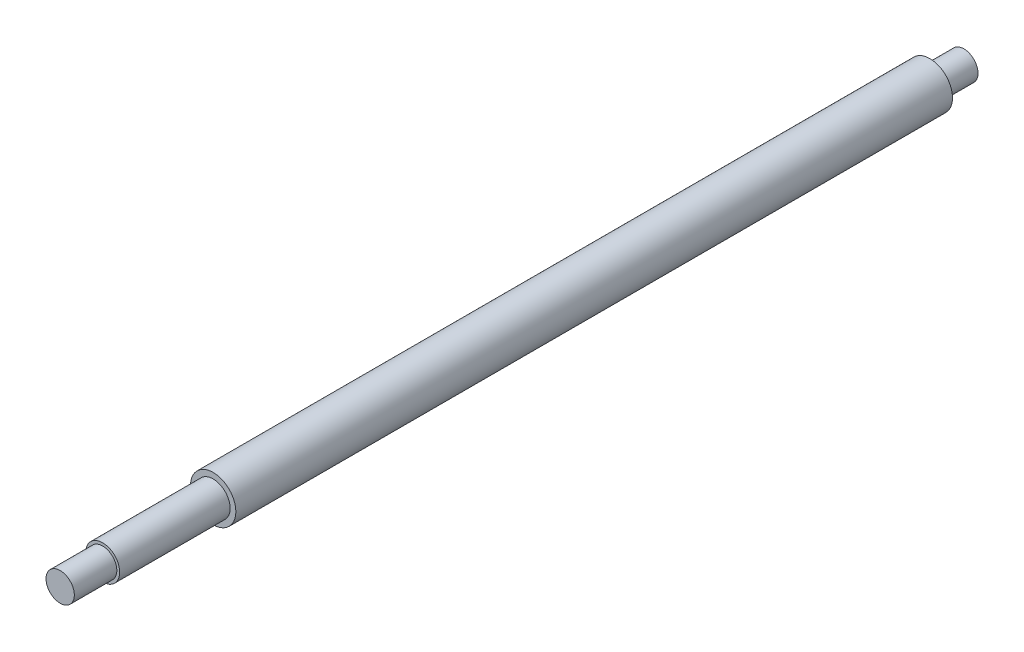
ISO-10303-21;
HEADER;
FILE_DESCRIPTION(('STEP AP214'),'2;1');
FILE_NAME('part.step','',(''),(''),'','','');
FILE_SCHEMA(('AUTOMOTIVE_DESIGN { 1 0 10303 214 1 1 1 1 }'));
ENDSEC;
DATA;
#1=APPLICATION_CONTEXT('core data for automotive mechanical design processes');
#2=APPLICATION_PROTOCOL_DEFINITION('international standard','automotive_design',2000,#1);
#3=PRODUCT_CONTEXT('',#1,'mechanical');
#4=PRODUCT('Part','Part','',(#3));
#5=PRODUCT_RELATED_PRODUCT_CATEGORY('part','',(#4));
#6=PRODUCT_DEFINITION_FORMATION('','',#4);
#7=PRODUCT_DEFINITION_CONTEXT('part definition',#1,'design');
#8=PRODUCT_DEFINITION('design','',#6,#7);
#9=PRODUCT_DEFINITION_SHAPE('','',#8);
#10=(LENGTH_UNIT() NAMED_UNIT(*) SI_UNIT(.MILLI.,.METRE.));
#11=(NAMED_UNIT(*) PLANE_ANGLE_UNIT() SI_UNIT($,.RADIAN.));
#12=(NAMED_UNIT(*) SI_UNIT($,.STERADIAN.) SOLID_ANGLE_UNIT());
#13=UNCERTAINTY_MEASURE_WITH_UNIT(LENGTH_MEASURE(1.E-05),#10,'distance_accuracy_value','');
#14=(GEOMETRIC_REPRESENTATION_CONTEXT(3) GLOBAL_UNCERTAINTY_ASSIGNED_CONTEXT((#13)) GLOBAL_UNIT_ASSIGNED_CONTEXT((#10,
#11,#12)) REPRESENTATION_CONTEXT('',''));
#15=CARTESIAN_POINT('',(0.,0.,0.));
#16=DIRECTION('',(0.,0.,1.));
#17=DIRECTION('',(1.,0.,0.));
#18=AXIS2_PLACEMENT_3D('',#15,#16,#17);
#19=CARTESIAN_POINT('',(0.,0.,318.98));
#20=DIRECTION('',(0.,0.,1.));
#21=DIRECTION('',(1.,0.,0.));
#22=AXIS2_PLACEMENT_3D('',#19,#20,#21);
#23=PLANE('',#22);
#24=CARTESIAN_POINT('',(0.,0.,318.98));
#25=DIRECTION('',(0.,0.,-1.));
#26=DIRECTION('',(-1.,0.,0.));
#27=AXIS2_PLACEMENT_3D('',#24,#25,#26);
#28=CIRCLE('',#27,4.99999999999994);
#29=CARTESIAN_POINT('',(-4.99999999999994,0.,318.98));
#30=VERTEX_POINT('',#29);
#31=EDGE_CURVE('E10',#30,#30,#28,.T.);
#32=ORIENTED_EDGE('',*,*,#31,.F.);
#33=EDGE_LOOP('',(#32));
#34=FACE_BOUND('',#33,.T.);
#35=ADVANCED_FACE('F34',(#34),#23,.T.);
#36=CARTESIAN_POINT('',(0.,0.,0.));
#37=DIRECTION('',(0.,0.,-1.));
#38=DIRECTION('',(-1.,0.,0.));
#39=AXIS2_PLACEMENT_3D('',#36,#37,#38);
#40=CYLINDRICAL_SURFACE('',#39,4.99999999999994);
#41=ORIENTED_EDGE('',*,*,#31,.T.);
#42=EDGE_LOOP('',(#41));
#43=FACE_BOUND('',#42,.T.);
#44=CARTESIAN_POINT('',(0.,0.,303.98));
#45=DIRECTION('',(0.,0.,-1.));
#46=DIRECTION('',(-1.,0.,0.));
#47=AXIS2_PLACEMENT_3D('',#44,#45,#46);
#48=CIRCLE('',#47,4.99999999999994);
#49=CARTESIAN_POINT('',(-4.99999999999994,0.,303.98));
#50=VERTEX_POINT('',#49);
#51=EDGE_CURVE('E40',#50,#50,#48,.T.);
#52=ORIENTED_EDGE('',*,*,#51,.F.);
#53=EDGE_LOOP('',(#52));
#54=FACE_BOUND('',#53,.T.);
#55=ADVANCED_FACE('F82',(#43,#54),#40,.T.);
#56=CARTESIAN_POINT('',(0.,4.99999999999994,303.98));
#57=DIRECTION('',(0.,0.,1.));
#58=DIRECTION('',(1.,0.,0.));
#59=AXIS2_PLACEMENT_3D('',#56,#57,#58);
#60=PLANE('',#59);
#61=ORIENTED_EDGE('',*,*,#51,.T.);
#62=EDGE_LOOP('',(#61));
#63=FACE_BOUND('',#62,.T.);
#64=CARTESIAN_POINT('',(0.,0.,303.98));
#65=DIRECTION('',(0.,0.,-1.));
#66=DIRECTION('',(-1.,0.,0.));
#67=AXIS2_PLACEMENT_3D('',#64,#65,#66);
#68=CIRCLE('',#67,5.99999999999994);
#69=CARTESIAN_POINT('',(-5.99999999999994,0.,303.98));
#70=VERTEX_POINT('',#69);
#71=EDGE_CURVE('E44',#70,#70,#68,.T.);
#72=ORIENTED_EDGE('',*,*,#71,.F.);
#73=EDGE_LOOP('',(#72));
#74=FACE_BOUND('',#73,.T.);
#75=ADVANCED_FACE('F87',(#63,#74),#60,.T.);
#76=CARTESIAN_POINT('',(0.,0.,0.));
#77=DIRECTION('',(0.,0.,-1.));
#78=DIRECTION('',(-1.,0.,0.));
#79=AXIS2_PLACEMENT_3D('',#76,#77,#78);
#80=CYLINDRICAL_SURFACE('',#79,5.99999999999994);
#81=ORIENTED_EDGE('',*,*,#71,.T.);
#82=EDGE_LOOP('',(#81));
#83=FACE_BOUND('',#82,.T.);
#84=CARTESIAN_POINT('',(0.,0.,264.98));
#85=DIRECTION('',(0.,0.,-1.));
#86=DIRECTION('',(-1.,0.,0.));
#87=AXIS2_PLACEMENT_3D('',#84,#85,#86);
#88=CIRCLE('',#87,5.99999999999994);
#89=CARTESIAN_POINT('',(-5.99999999999994,0.,264.98));
#90=VERTEX_POINT('',#89);
#91=EDGE_CURVE('E48',#90,#90,#88,.T.);
#92=ORIENTED_EDGE('',*,*,#91,.F.);
#93=EDGE_LOOP('',(#92));
#94=FACE_BOUND('',#93,.T.);
#95=ADVANCED_FACE('F91',(#83,#94),#80,.T.);
#96=CARTESIAN_POINT('',(0.,5.99999999999994,264.98));
#97=DIRECTION('',(0.,0.,1.));
#98=DIRECTION('',(1.,0.,0.));
#99=AXIS2_PLACEMENT_3D('',#96,#97,#98);
#100=PLANE('',#99);
#101=ORIENTED_EDGE('',*,*,#91,.T.);
#102=EDGE_LOOP('',(#101));
#103=FACE_BOUND('',#102,.T.);
#104=CARTESIAN_POINT('',(0.,0.,264.98));
#105=DIRECTION('',(0.,0.,-1.));
#106=DIRECTION('',(-1.,0.,0.));
#107=AXIS2_PLACEMENT_3D('',#104,#105,#106);
#108=CIRCLE('',#107,7.99999999999995);
#109=CARTESIAN_POINT('',(-7.99999999999995,0.,264.98));
#110=VERTEX_POINT('',#109);
#111=EDGE_CURVE('E53',#110,#110,#108,.T.);
#112=ORIENTED_EDGE('',*,*,#111,.F.);
#113=EDGE_LOOP('',(#112));
#114=FACE_BOUND('',#113,.T.);
#115=ADVANCED_FACE('F97',(#103,#114),#100,.T.);
#116=CARTESIAN_POINT('',(0.,0.,0.));
#117=DIRECTION('',(0.,0.,-1.));
#118=DIRECTION('',(-1.,0.,0.));
#119=AXIS2_PLACEMENT_3D('',#116,#117,#118);
#120=CYLINDRICAL_SURFACE('',#119,7.99999999999997);
#121=ORIENTED_EDGE('',*,*,#111,.T.);
#122=EDGE_LOOP('',(#121));
#123=FACE_BOUND('',#122,.T.);
#124=CARTESIAN_POINT('',(0.,0.,12.));
#125=DIRECTION('',(0.,0.,-1.));
#126=DIRECTION('',(-1.,0.,0.));
#127=AXIS2_PLACEMENT_3D('',#124,#125,#126);
#128=CIRCLE('',#127,7.99999999999999);
#129=CARTESIAN_POINT('',(-7.99999999999999,0.,12.));
#130=VERTEX_POINT('',#129);
#131=EDGE_CURVE('E56',#130,#130,#128,.T.);
#132=ORIENTED_EDGE('',*,*,#131,.F.);
#133=EDGE_LOOP('',(#132));
#134=FACE_BOUND('',#133,.T.);
#135=ADVANCED_FACE('F78',(#123,#134),#120,.T.);
#136=CARTESIAN_POINT('',(0.,7.99999999999999,12.));
#137=DIRECTION('',(0.,0.,-1.));
#138=DIRECTION('',(-1.,0.,0.));
#139=AXIS2_PLACEMENT_3D('',#136,#137,#138);
#140=PLANE('',#139);
#141=ORIENTED_EDGE('',*,*,#131,.T.);
#142=EDGE_LOOP('',(#141));
#143=FACE_BOUND('',#142,.T.);
#144=CARTESIAN_POINT('',(0.,0.,12.));
#145=DIRECTION('',(0.,0.,-1.));
#146=DIRECTION('',(-1.,0.,0.));
#147=AXIS2_PLACEMENT_3D('',#144,#145,#146);
#148=CIRCLE('',#147,5.);
#149=CARTESIAN_POINT('',(-5.,0.,12.));
#150=VERTEX_POINT('',#149);
#151=EDGE_CURVE('E59',#150,#150,#148,.T.);
#152=ORIENTED_EDGE('',*,*,#151,.F.);
#153=EDGE_LOOP('',(#152));
#154=FACE_BOUND('',#153,.T.);
#155=ADVANCED_FACE('F70',(#143,#154),#140,.T.);
#156=CARTESIAN_POINT('',(0.,0.,0.));
#157=DIRECTION('',(0.,0.,-1.));
#158=DIRECTION('',(-1.,0.,0.));
#159=AXIS2_PLACEMENT_3D('',#156,#157,#158);
#160=CYLINDRICAL_SURFACE('',#159,5.);
#161=ORIENTED_EDGE('',*,*,#151,.T.);
#162=EDGE_LOOP('',(#161));
#163=FACE_BOUND('',#162,.T.);
#164=CARTESIAN_POINT('',(0.,0.,0.));
#165=DIRECTION('',(0.,0.,-1.));
#166=DIRECTION('',(-1.,0.,0.));
#167=AXIS2_PLACEMENT_3D('',#164,#165,#166);
#168=CIRCLE('',#167,5.);
#169=CARTESIAN_POINT('',(-5.,0.,0.));
#170=VERTEX_POINT('',#169);
#171=EDGE_CURVE('E62',#170,#170,#168,.T.);
#172=ORIENTED_EDGE('',*,*,#171,.F.);
#173=EDGE_LOOP('',(#172));
#174=FACE_BOUND('',#173,.T.);
#175=ADVANCED_FACE('F68',(#163,#174),#160,.T.);
#176=CARTESIAN_POINT('',(0.,5.,0.));
#177=DIRECTION('',(0.,0.,-1.));
#178=DIRECTION('',(-1.,0.,0.));
#179=AXIS2_PLACEMENT_3D('',#176,#177,#178);
#180=PLANE('',#179);
#181=ORIENTED_EDGE('',*,*,#171,.T.);
#182=EDGE_LOOP('',(#181));
#183=FACE_BOUND('',#182,.T.);
#184=ADVANCED_FACE('F66',(#183),#180,.T.);
#185=CLOSED_SHELL('',(#35,#55,#75,#95,#115,#135,#155,#175,#184));
#186=MANIFOLD_SOLID_BREP('B2',#185);
#187=ADVANCED_BREP_SHAPE_REPRESENTATION('',(#18,#186),#14);
#188=SHAPE_DEFINITION_REPRESENTATION(#9,#187);
ENDSEC;
END-ISO-10303-21;
